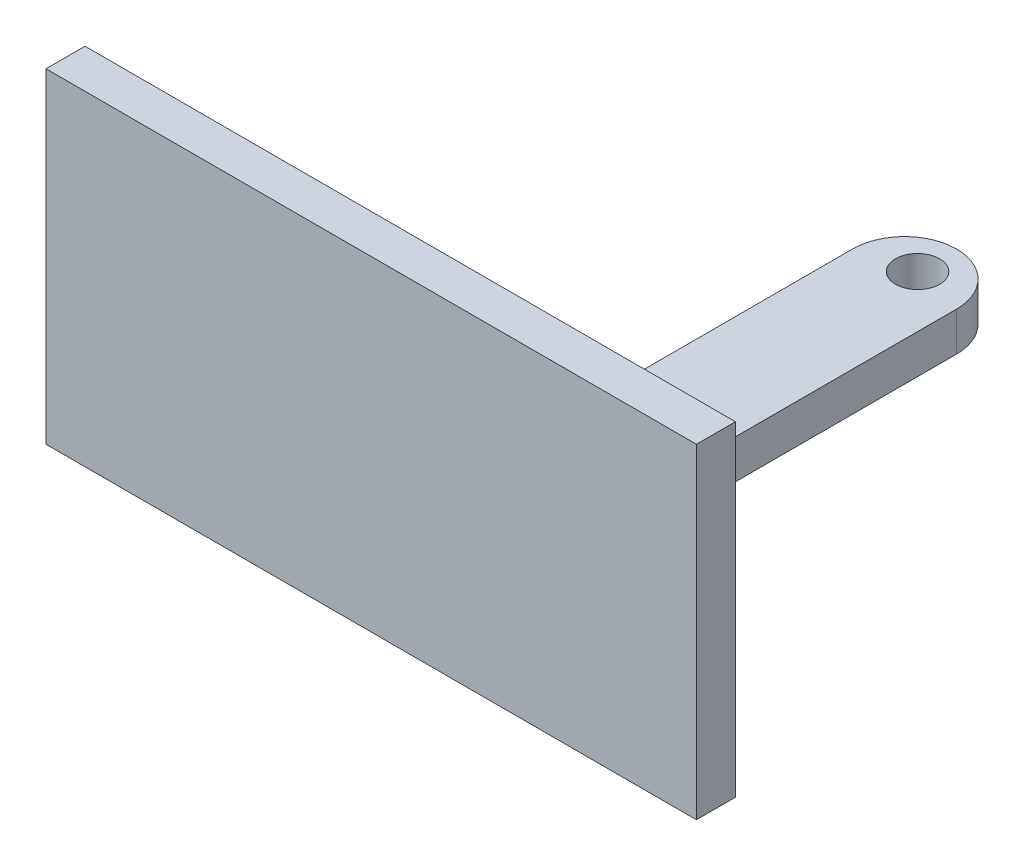
ISO-10303-21;
HEADER;
FILE_DESCRIPTION(('STEP AP214'),'2;1');
FILE_NAME('part.step','',(''),(''),'','','');
FILE_SCHEMA(('AUTOMOTIVE_DESIGN { 1 0 10303 214 1 1 1 1 }'));
ENDSEC;
DATA;
#1=APPLICATION_CONTEXT('core data for automotive mechanical design processes');
#2=APPLICATION_PROTOCOL_DEFINITION('international standard','automotive_design',2000,#1);
#3=PRODUCT_CONTEXT('',#1,'mechanical');
#4=PRODUCT('Part','Part','',(#3));
#5=PRODUCT_RELATED_PRODUCT_CATEGORY('part','',(#4));
#6=PRODUCT_DEFINITION_FORMATION('','',#4);
#7=PRODUCT_DEFINITION_CONTEXT('part definition',#1,'design');
#8=PRODUCT_DEFINITION('design','',#6,#7);
#9=PRODUCT_DEFINITION_SHAPE('','',#8);
#10=(LENGTH_UNIT() NAMED_UNIT(*) SI_UNIT(.MILLI.,.METRE.));
#11=(NAMED_UNIT(*) PLANE_ANGLE_UNIT() SI_UNIT($,.RADIAN.));
#12=(NAMED_UNIT(*) SI_UNIT($,.STERADIAN.) SOLID_ANGLE_UNIT());
#13=UNCERTAINTY_MEASURE_WITH_UNIT(LENGTH_MEASURE(1.E-05),#10,'distance_accuracy_value','');
#14=(GEOMETRIC_REPRESENTATION_CONTEXT(3) GLOBAL_UNCERTAINTY_ASSIGNED_CONTEXT((#13)) GLOBAL_UNIT_ASSIGNED_CONTEXT((#10,
#11,#12)) REPRESENTATION_CONTEXT('',''));
#15=CARTESIAN_POINT('',(0.,0.,0.));
#16=DIRECTION('',(0.,0.,1.));
#17=DIRECTION('',(1.,0.,0.));
#18=AXIS2_PLACEMENT_3D('',#15,#16,#17);
#19=CARTESIAN_POINT('',(0.,0.,-3.));
#20=DIRECTION('',(0.,0.,1.));
#21=DIRECTION('',(1.,0.,0.));
#22=AXIS2_PLACEMENT_3D('',#19,#20,#21);
#23=PLANE('',#22);
#24=DIRECTION('',(0.,1.,0.));
#25=VECTOR('',#24,1.);
#26=CARTESIAN_POINT('',(21.,-25.,-3.));
#27=LINE('',#26,#25);
#28=CARTESIAN_POINT('',(21.,-25.,-3.));
#29=VERTEX_POINT('',#28);
#30=CARTESIAN_POINT('',(21.,-22.,-3.));
#31=VERTEX_POINT('',#30);
#32=EDGE_CURVE('E126',#29,#31,#27,.T.);
#33=ORIENTED_EDGE('',*,*,#32,.F.);
#34=DIRECTION('',(1.,0.,0.));
#35=VECTOR('',#34,1.);
#36=CARTESIAN_POINT('',(0.,-25.,-3.));
#37=LINE('',#36,#35);
#38=CARTESIAN_POINT('',(0.,-25.,-3.));
#39=VERTEX_POINT('',#38);
#40=EDGE_CURVE('E141',#39,#29,#37,.T.);
#41=ORIENTED_EDGE('',*,*,#40,.F.);
#42=DIRECTION('',(0.,-1.,0.));
#43=VECTOR('',#42,1.);
#44=CARTESIAN_POINT('',(0.,0.,-3.));
#45=LINE('',#44,#43);
#46=CARTESIAN_POINT('',(0.,0.,-3.));
#47=VERTEX_POINT('',#46);
#48=EDGE_CURVE('E137',#47,#39,#45,.T.);
#49=ORIENTED_EDGE('',*,*,#48,.F.);
#50=DIRECTION('',(-1.,0.,0.));
#51=VECTOR('',#50,1.);
#52=CARTESIAN_POINT('',(0.,0.,-3.));
#53=LINE('',#52,#51);
#54=CARTESIAN_POINT('',(50.,0.,-3.));
#55=VERTEX_POINT('',#54);
#56=EDGE_CURVE('E147',#55,#47,#53,.T.);
#57=ORIENTED_EDGE('',*,*,#56,.F.);
#58=DIRECTION('',(0.,1.,0.));
#59=VECTOR('',#58,1.);
#60=CARTESIAN_POINT('',(50.,0.,-3.));
#61=LINE('',#60,#59);
#62=CARTESIAN_POINT('',(50.,-25.,-3.));
#63=VERTEX_POINT('',#62);
#64=EDGE_CURVE('E144',#63,#55,#61,.T.);
#65=ORIENTED_EDGE('',*,*,#64,.F.);
#66=CARTESIAN_POINT('',(29.,-25.,-3.));
#67=VERTEX_POINT('',#66);
#68=EDGE_CURVE('E123',#67,#63,#37,.T.);
#69=ORIENTED_EDGE('',*,*,#68,.F.);
#70=DIRECTION('',(0.,-1.,0.));
#71=VECTOR('',#70,1.);
#72=CARTESIAN_POINT('',(29.,-25.,-3.));
#73=LINE('',#72,#71);
#74=CARTESIAN_POINT('',(29.,-22.,-3.));
#75=VERTEX_POINT('',#74);
#76=EDGE_CURVE('E108',#75,#67,#73,.T.);
#77=ORIENTED_EDGE('',*,*,#76,.F.);
#78=DIRECTION('',(1.,0.,0.));
#79=VECTOR('',#78,1.);
#80=CARTESIAN_POINT('',(25.,-22.,-3.));
#81=LINE('',#80,#79);
#82=EDGE_CURVE('E120',#31,#75,#81,.T.);
#83=ORIENTED_EDGE('',*,*,#82,.F.);
#84=EDGE_LOOP('',(#33,#41,#49,#57,#65,#69,#77,#83));
#85=FACE_BOUND('',#84,.T.);
#86=ADVANCED_FACE('F35',(#85),#23,.F.);
#87=CARTESIAN_POINT('',(0.,0.,-3.));
#88=DIRECTION('',(-1.,0.,0.));
#89=DIRECTION('',(0.,-1.,0.));
#90=AXIS2_PLACEMENT_3D('',#87,#88,#89);
#91=PLANE('',#90);
#92=DIRECTION('',(0.,-1.,0.));
#93=VECTOR('',#92,1.);
#94=CARTESIAN_POINT('',(0.,0.,0.));
#95=LINE('',#94,#93);
#96=CARTESIAN_POINT('',(0.,0.,0.));
#97=VERTEX_POINT('',#96);
#98=CARTESIAN_POINT('',(0.,-25.,0.));
#99=VERTEX_POINT('',#98);
#100=EDGE_CURVE('E136',#97,#99,#95,.T.);
#101=ORIENTED_EDGE('',*,*,#100,.F.);
#102=DIRECTION('',(0.,0.,1.));
#103=VECTOR('',#102,1.);
#104=CARTESIAN_POINT('',(0.,0.,-3.));
#105=LINE('',#104,#103);
#106=EDGE_CURVE('E161',#47,#97,#105,.T.);
#107=ORIENTED_EDGE('',*,*,#106,.F.);
#108=ORIENTED_EDGE('',*,*,#48,.T.);
#109=DIRECTION('',(0.,0.,1.));
#110=VECTOR('',#109,1.);
#111=CARTESIAN_POINT('',(0.,-25.,-3.));
#112=LINE('',#111,#110);
#113=EDGE_CURVE('E150',#39,#99,#112,.T.);
#114=ORIENTED_EDGE('',*,*,#113,.T.);
#115=EDGE_LOOP('',(#101,#107,#108,#114));
#116=FACE_BOUND('',#115,.T.);
#117=ADVANCED_FACE('F190',(#116),#91,.T.);
#118=CARTESIAN_POINT('',(0.,0.,-3.));
#119=DIRECTION('',(0.,1.,0.));
#120=DIRECTION('',(0.,0.,1.));
#121=AXIS2_PLACEMENT_3D('',#118,#119,#120);
#122=PLANE('',#121);
#123=DIRECTION('',(-1.,0.,0.));
#124=VECTOR('',#123,1.);
#125=CARTESIAN_POINT('',(0.,0.,0.));
#126=LINE('',#125,#124);
#127=CARTESIAN_POINT('',(50.,0.,0.));
#128=VERTEX_POINT('',#127);
#129=EDGE_CURVE('E140',#128,#97,#126,.T.);
#130=ORIENTED_EDGE('',*,*,#129,.F.);
#131=DIRECTION('',(0.,0.,1.));
#132=VECTOR('',#131,1.);
#133=CARTESIAN_POINT('',(50.,0.,-3.));
#134=LINE('',#133,#132);
#135=EDGE_CURVE('E164',#55,#128,#134,.T.);
#136=ORIENTED_EDGE('',*,*,#135,.F.);
#137=ORIENTED_EDGE('',*,*,#56,.T.);
#138=ORIENTED_EDGE('',*,*,#106,.T.);
#139=EDGE_LOOP('',(#130,#136,#137,#138));
#140=FACE_BOUND('',#139,.T.);
#141=ADVANCED_FACE('F194',(#140),#122,.T.);
#142=CARTESIAN_POINT('',(50.,0.,-3.));
#143=DIRECTION('',(1.,0.,0.));
#144=DIRECTION('',(0.,0.,-1.));
#145=AXIS2_PLACEMENT_3D('',#142,#143,#144);
#146=PLANE('',#145);
#147=DIRECTION('',(0.,1.,0.));
#148=VECTOR('',#147,1.);
#149=CARTESIAN_POINT('',(50.,0.,0.));
#150=LINE('',#149,#148);
#151=CARTESIAN_POINT('',(50.,-25.,0.));
#152=VERTEX_POINT('',#151);
#153=EDGE_CURVE('E156',#152,#128,#150,.T.);
#154=ORIENTED_EDGE('',*,*,#153,.F.);
#155=DIRECTION('',(0.,0.,1.));
#156=VECTOR('',#155,1.);
#157=CARTESIAN_POINT('',(50.,-25.,-3.));
#158=LINE('',#157,#156);
#159=EDGE_CURVE('E166',#63,#152,#158,.T.);
#160=ORIENTED_EDGE('',*,*,#159,.F.);
#161=ORIENTED_EDGE('',*,*,#64,.T.);
#162=ORIENTED_EDGE('',*,*,#135,.T.);
#163=EDGE_LOOP('',(#154,#160,#161,#162));
#164=FACE_BOUND('',#163,.T.);
#165=ADVANCED_FACE('F198',(#164),#146,.T.);
#166=CARTESIAN_POINT('',(0.,-25.,-3.));
#167=DIRECTION('',(0.,-1.,0.));
#168=DIRECTION('',(0.,0.,-1.));
#169=AXIS2_PLACEMENT_3D('',#166,#167,#168);
#170=PLANE('',#169);
#171=CARTESIAN_POINT('',(25.,-25.,-42.));
#172=DIRECTION('',(0.,1.,0.));
#173=DIRECTION('',(0.,0.,1.));
#174=AXIS2_PLACEMENT_3D('',#171,#172,#173);
#175=CIRCLE('',#174,1.7);
#176=CARTESIAN_POINT('',(25.,-25.,-40.3));
#177=VERTEX_POINT('',#176);
#178=EDGE_CURVE('E128',#177,#177,#175,.T.);
#179=ORIENTED_EDGE('',*,*,#178,.T.);
#180=EDGE_LOOP('',(#179));
#181=FACE_BOUND('',#180,.T.);
#182=CARTESIAN_POINT('',(25.,-25.,-15.3));
#183=DIRECTION('',(0.,1.,0.));
#184=DIRECTION('',(0.,0.,1.));
#185=AXIS2_PLACEMENT_3D('',#182,#183,#184);
#186=CIRCLE('',#185,1.7);
#187=CARTESIAN_POINT('',(25.,-25.,-13.6));
#188=VERTEX_POINT('',#187);
#189=EDGE_CURVE('E239',#188,#188,#186,.T.);
#190=ORIENTED_EDGE('',*,*,#189,.T.);
#191=EDGE_LOOP('',(#190));
#192=FACE_BOUND('',#191,.T.);
#193=DIRECTION('',(0.,0.,1.));
#194=VECTOR('',#193,1.);
#195=CARTESIAN_POINT('',(21.,-25.,-45.));
#196=LINE('',#195,#194);
#197=CARTESIAN_POINT('',(21.,-25.,-41.));
#198=VERTEX_POINT('',#197);
#199=EDGE_CURVE('E134',#198,#29,#196,.T.);
#200=ORIENTED_EDGE('',*,*,#199,.F.);
#201=CARTESIAN_POINT('',(25.,-25.,-41.));
#202=DIRECTION('',(0.,-1.,0.));
#203=DIRECTION('',(0.,0.,-1.));
#204=AXIS2_PLACEMENT_3D('',#201,#202,#203);
#205=CIRCLE('',#204,4.);
#206=CARTESIAN_POINT('',(25.,-25.,-45.));
#207=VERTEX_POINT('',#206);
#208=EDGE_CURVE('E11',#198,#207,#205,.T.);
#209=ORIENTED_EDGE('',*,*,#208,.T.);
#210=CARTESIAN_POINT('',(25.,-25.,-41.));
#211=DIRECTION('',(0.,-1.,0.));
#212=DIRECTION('',(0.,0.,-1.));
#213=AXIS2_PLACEMENT_3D('',#210,#211,#212);
#214=CIRCLE('',#213,4.);
#215=CARTESIAN_POINT('',(29.,-25.,-41.));
#216=VERTEX_POINT('',#215);
#217=EDGE_CURVE('E171',#207,#216,#214,.T.);
#218=ORIENTED_EDGE('',*,*,#217,.T.);
#219=DIRECTION('',(0.,0.,1.));
#220=VECTOR('',#219,1.);
#221=CARTESIAN_POINT('',(29.,-25.,-45.));
#222=LINE('',#221,#220);
#223=EDGE_CURVE('E114',#216,#67,#222,.T.);
#224=ORIENTED_EDGE('',*,*,#223,.T.);
#225=ORIENTED_EDGE('',*,*,#68,.T.);
#226=ORIENTED_EDGE('',*,*,#159,.T.);
#227=DIRECTION('',(1.,0.,0.));
#228=VECTOR('',#227,1.);
#229=CARTESIAN_POINT('',(0.,-25.,0.));
#230=LINE('',#229,#228);
#231=EDGE_CURVE('E153',#99,#152,#230,.T.);
#232=ORIENTED_EDGE('',*,*,#231,.F.);
#233=ORIENTED_EDGE('',*,*,#113,.F.);
#234=ORIENTED_EDGE('',*,*,#40,.T.);
#235=EDGE_LOOP('',(#200,#209,#218,#224,#225,#226,#232,#233,#234));
#236=FACE_BOUND('',#235,.T.);
#237=ADVANCED_FACE('F183',(#181,#192,#236),#170,.T.);
#238=CARTESIAN_POINT('',(0.,0.,0.));
#239=DIRECTION('',(0.,0.,1.));
#240=DIRECTION('',(1.,0.,0.));
#241=AXIS2_PLACEMENT_3D('',#238,#239,#240);
#242=PLANE('',#241);
#243=ORIENTED_EDGE('',*,*,#100,.T.);
#244=ORIENTED_EDGE('',*,*,#231,.T.);
#245=ORIENTED_EDGE('',*,*,#153,.T.);
#246=ORIENTED_EDGE('',*,*,#129,.T.);
#247=EDGE_LOOP('',(#243,#244,#245,#246));
#248=FACE_BOUND('',#247,.T.);
#249=ADVANCED_FACE('F200',(#248),#242,.T.);
#250=CARTESIAN_POINT('',(21.,-25.,-45.));
#251=DIRECTION('',(1.,0.,0.));
#252=DIRECTION('',(0.,0.,-1.));
#253=AXIS2_PLACEMENT_3D('',#250,#251,#252);
#254=PLANE('',#253);
#255=DIRECTION('',(0.,0.,1.));
#256=VECTOR('',#255,1.);
#257=CARTESIAN_POINT('',(21.,-22.,-45.));
#258=LINE('',#257,#256);
#259=CARTESIAN_POINT('',(21.,-22.,-41.));
#260=VERTEX_POINT('',#259);
#261=EDGE_CURVE('E113',#260,#31,#258,.T.);
#262=ORIENTED_EDGE('',*,*,#261,.F.);
#263=DIRECTION('',(0.,1.,0.));
#264=VECTOR('',#263,1.);
#265=CARTESIAN_POINT('',(21.,-25.,-41.));
#266=LINE('',#265,#264);
#267=EDGE_CURVE('E43',#260,#198,#266,.F.);
#268=ORIENTED_EDGE('',*,*,#267,.T.);
#269=ORIENTED_EDGE('',*,*,#199,.T.);
#270=ORIENTED_EDGE('',*,*,#32,.T.);
#271=EDGE_LOOP('',(#262,#268,#269,#270));
#272=FACE_BOUND('',#271,.T.);
#273=ADVANCED_FACE('F185',(#272),#254,.F.);
#274=CARTESIAN_POINT('',(25.,-22.,-45.));
#275=DIRECTION('',(0.,-1.,0.));
#276=DIRECTION('',(0.,0.,-1.));
#277=AXIS2_PLACEMENT_3D('',#274,#275,#276);
#278=PLANE('',#277);
#279=CARTESIAN_POINT('',(25.,-22.,-42.));
#280=DIRECTION('',(0.,1.,0.));
#281=DIRECTION('',(0.,0.,1.));
#282=AXIS2_PLACEMENT_3D('',#279,#280,#281);
#283=CIRCLE('',#282,1.7);
#284=CARTESIAN_POINT('',(25.,-22.,-40.3));
#285=VERTEX_POINT('',#284);
#286=EDGE_CURVE('E238',#285,#285,#283,.T.);
#287=ORIENTED_EDGE('',*,*,#286,.F.);
#288=EDGE_LOOP('',(#287));
#289=FACE_BOUND('',#288,.T.);
#290=CARTESIAN_POINT('',(25.,-22.,-15.3));
#291=DIRECTION('',(0.,1.,0.));
#292=DIRECTION('',(0.,0.,1.));
#293=AXIS2_PLACEMENT_3D('',#290,#291,#292);
#294=CIRCLE('',#293,1.7);
#295=CARTESIAN_POINT('',(25.,-22.,-13.6));
#296=VERTEX_POINT('',#295);
#297=EDGE_CURVE('E243',#296,#296,#294,.T.);
#298=ORIENTED_EDGE('',*,*,#297,.F.);
#299=EDGE_LOOP('',(#298));
#300=FACE_BOUND('',#299,.T.);
#301=CARTESIAN_POINT('',(25.,-22.,-41.));
#302=DIRECTION('',(0.,-1.,0.));
#303=DIRECTION('',(0.,0.,-1.));
#304=AXIS2_PLACEMENT_3D('',#301,#302,#303);
#305=CIRCLE('',#304,4.);
#306=CARTESIAN_POINT('',(29.,-22.,-41.));
#307=VERTEX_POINT('',#306);
#308=CARTESIAN_POINT('',(25.,-22.,-45.));
#309=VERTEX_POINT('',#308);
#310=EDGE_CURVE('E174',#307,#309,#305,.F.);
#311=ORIENTED_EDGE('',*,*,#310,.T.);
#312=CARTESIAN_POINT('',(25.,-22.,-41.));
#313=DIRECTION('',(0.,-1.,0.));
#314=DIRECTION('',(0.,0.,-1.));
#315=AXIS2_PLACEMENT_3D('',#312,#313,#314);
#316=CIRCLE('',#315,4.);
#317=EDGE_CURVE('E57',#309,#260,#316,.F.);
#318=ORIENTED_EDGE('',*,*,#317,.T.);
#319=ORIENTED_EDGE('',*,*,#261,.T.);
#320=ORIENTED_EDGE('',*,*,#82,.T.);
#321=DIRECTION('',(0.,0.,1.));
#322=VECTOR('',#321,1.);
#323=CARTESIAN_POINT('',(29.,-22.,-45.));
#324=LINE('',#323,#322);
#325=EDGE_CURVE('E104',#307,#75,#324,.T.);
#326=ORIENTED_EDGE('',*,*,#325,.F.);
#327=EDGE_LOOP('',(#311,#318,#319,#320,#326));
#328=FACE_BOUND('',#327,.T.);
#329=ADVANCED_FACE('F125',(#289,#300,#328),#278,.F.);
#330=CARTESIAN_POINT('',(29.,-25.,-45.));
#331=DIRECTION('',(-1.,0.,0.));
#332=DIRECTION('',(0.,0.,1.));
#333=AXIS2_PLACEMENT_3D('',#330,#331,#332);
#334=PLANE('',#333);
#335=ORIENTED_EDGE('',*,*,#223,.F.);
#336=DIRECTION('',(0.,-1.,0.));
#337=VECTOR('',#336,1.);
#338=CARTESIAN_POINT('',(29.,-22.,-41.));
#339=LINE('',#338,#337);
#340=EDGE_CURVE('E110',#216,#307,#339,.F.);
#341=ORIENTED_EDGE('',*,*,#340,.T.);
#342=ORIENTED_EDGE('',*,*,#325,.T.);
#343=ORIENTED_EDGE('',*,*,#76,.T.);
#344=EDGE_LOOP('',(#335,#341,#342,#343));
#345=FACE_BOUND('',#344,.T.);
#346=ADVANCED_FACE('F107',(#345),#334,.F.);
#347=CARTESIAN_POINT('',(25.,-25.,-15.3));
#348=DIRECTION('',(0.,1.,0.));
#349=DIRECTION('',(0.,0.,1.));
#350=AXIS2_PLACEMENT_3D('',#347,#348,#349);
#351=CYLINDRICAL_SURFACE('',#350,1.7);
#352=ORIENTED_EDGE('',*,*,#189,.F.);
#353=EDGE_LOOP('',(#352));
#354=FACE_BOUND('',#353,.T.);
#355=ORIENTED_EDGE('',*,*,#297,.T.);
#356=EDGE_LOOP('',(#355));
#357=FACE_BOUND('',#356,.T.);
#358=ADVANCED_FACE('F223',(#354,#357),#351,.F.);
#359=CARTESIAN_POINT('',(25.,-25.,-42.));
#360=DIRECTION('',(0.,1.,0.));
#361=DIRECTION('',(0.,0.,1.));
#362=AXIS2_PLACEMENT_3D('',#359,#360,#361);
#363=CYLINDRICAL_SURFACE('',#362,1.7);
#364=ORIENTED_EDGE('',*,*,#178,.F.);
#365=EDGE_LOOP('',(#364));
#366=FACE_BOUND('',#365,.T.);
#367=ORIENTED_EDGE('',*,*,#286,.T.);
#368=EDGE_LOOP('',(#367));
#369=FACE_BOUND('',#368,.T.);
#370=ADVANCED_FACE('F226',(#366,#369),#363,.F.);
#371=CARTESIAN_POINT('',(25.,0.,-41.));
#372=DIRECTION('',(0.,1.,0.));
#373=DIRECTION('',(0.,0.,1.));
#374=AXIS2_PLACEMENT_3D('',#371,#372,#373);
#375=CYLINDRICAL_SURFACE('',#374,4.);
#376=ORIENTED_EDGE('',*,*,#310,.F.);
#377=ORIENTED_EDGE('',*,*,#340,.F.);
#378=ORIENTED_EDGE('',*,*,#217,.F.);
#379=DIRECTION('',(0.,-1.,0.));
#380=VECTOR('',#379,1.);
#381=CARTESIAN_POINT('',(25.,-25.,-45.));
#382=LINE('',#381,#380);
#383=EDGE_CURVE('E163',#309,#207,#382,.T.);
#384=ORIENTED_EDGE('',*,*,#383,.F.);
#385=EDGE_LOOP('',(#376,#377,#378,#384));
#386=FACE_BOUND('',#385,.T.);
#387=ADVANCED_FACE('F179',(#386),#375,.T.);
#388=CARTESIAN_POINT('',(25.,0.,-41.));
#389=DIRECTION('',(0.,-1.,0.));
#390=DIRECTION('',(0.,0.,-1.));
#391=AXIS2_PLACEMENT_3D('',#388,#389,#390);
#392=CYLINDRICAL_SURFACE('',#391,4.);
#393=ORIENTED_EDGE('',*,*,#208,.F.);
#394=ORIENTED_EDGE('',*,*,#267,.F.);
#395=ORIENTED_EDGE('',*,*,#317,.F.);
#396=ORIENTED_EDGE('',*,*,#383,.T.);
#397=EDGE_LOOP('',(#393,#394,#395,#396));
#398=FACE_BOUND('',#397,.T.);
#399=ADVANCED_FACE('F37',(#398),#392,.T.);
#400=CLOSED_SHELL('',(#86,#117,#141,#165,#237,#249,#273,#329,#346,#358,#370,#387,#399));
#401=MANIFOLD_SOLID_BREP('B2',#400);
#402=ADVANCED_BREP_SHAPE_REPRESENTATION('',(#18,#401),#14);
#403=SHAPE_DEFINITION_REPRESENTATION(#9,#402);
ENDSEC;
END-ISO-10303-21;
